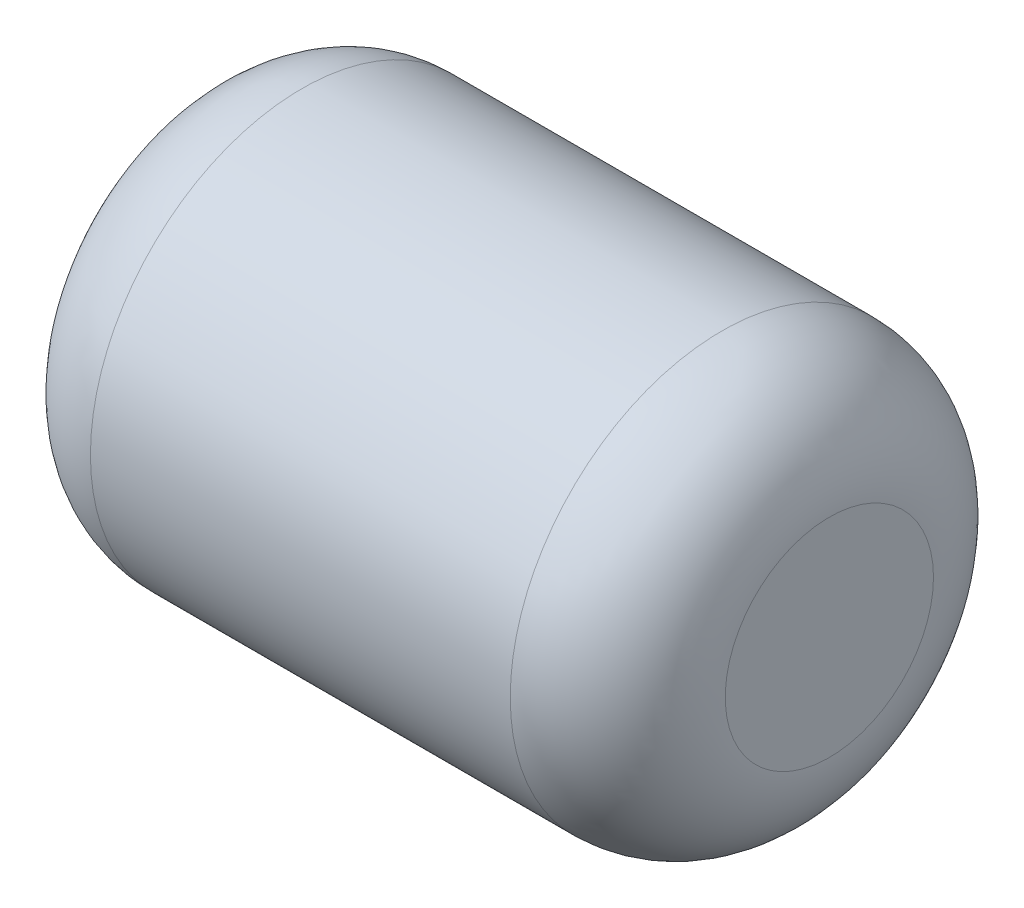
ISO-10303-21;
HEADER;
FILE_DESCRIPTION(('STEP AP214'),'2;1');
FILE_NAME('part.step','',(''),(''),'','','');
FILE_SCHEMA(('AUTOMOTIVE_DESIGN { 1 0 10303 214 1 1 1 1 }'));
ENDSEC;
DATA;
#1=APPLICATION_CONTEXT('core data for automotive mechanical design processes');
#2=APPLICATION_PROTOCOL_DEFINITION('international standard','automotive_design',2000,#1);
#3=PRODUCT_CONTEXT('',#1,'mechanical');
#4=PRODUCT('Part','Part','',(#3));
#5=PRODUCT_RELATED_PRODUCT_CATEGORY('part','',(#4));
#6=PRODUCT_DEFINITION_FORMATION('','',#4);
#7=PRODUCT_DEFINITION_CONTEXT('part definition',#1,'design');
#8=PRODUCT_DEFINITION('design','',#6,#7);
#9=PRODUCT_DEFINITION_SHAPE('','',#8);
#10=(LENGTH_UNIT() NAMED_UNIT(*) SI_UNIT(.MILLI.,.METRE.));
#11=(NAMED_UNIT(*) PLANE_ANGLE_UNIT() SI_UNIT($,.RADIAN.));
#12=(NAMED_UNIT(*) SI_UNIT($,.STERADIAN.) SOLID_ANGLE_UNIT());
#13=UNCERTAINTY_MEASURE_WITH_UNIT(LENGTH_MEASURE(1.E-05),#10,'distance_accuracy_value','');
#14=(GEOMETRIC_REPRESENTATION_CONTEXT(3) GLOBAL_UNCERTAINTY_ASSIGNED_CONTEXT((#13)) GLOBAL_UNIT_ASSIGNED_CONTEXT((#10,
#11,#12)) REPRESENTATION_CONTEXT('',''));
#15=CARTESIAN_POINT('',(0.,0.,0.));
#16=DIRECTION('',(0.,0.,1.));
#17=DIRECTION('',(1.,0.,0.));
#18=AXIS2_PLACEMENT_3D('',#15,#16,#17);
#19=CARTESIAN_POINT('',(3.,0.,0.));
#20=DIRECTION('',(-1.,0.,0.));
#21=DIRECTION('',(0.,0.,1.));
#22=AXIS2_PLACEMENT_3D('',#19,#20,#21);
#23=CYLINDRICAL_SURFACE('',#22,1.);
#24=CARTESIAN_POINT('',(0.508,0.,0.));
#25=DIRECTION('',(1.,0.,0.));
#26=DIRECTION('',(0.,0.,-1.));
#27=AXIS2_PLACEMENT_3D('',#24,#25,#26);
#28=CIRCLE('',#27,1.);
#29=CARTESIAN_POINT('',(0.508,0.,-1.));
#30=VERTEX_POINT('',#29);
#31=EDGE_CURVE('E41',#30,#30,#28,.T.);
#32=ORIENTED_EDGE('',*,*,#31,.T.);
#33=EDGE_LOOP('',(#32));
#34=FACE_BOUND('',#33,.T.);
#35=CARTESIAN_POINT('',(2.492,0.,0.));
#36=DIRECTION('',(1.,0.,0.));
#37=DIRECTION('',(0.,0.,-1.));
#38=AXIS2_PLACEMENT_3D('',#35,#36,#37);
#39=CIRCLE('',#38,1.);
#40=CARTESIAN_POINT('',(2.492,0.,-1.));
#41=VERTEX_POINT('',#40);
#42=EDGE_CURVE('E45',#41,#41,#39,.F.);
#43=ORIENTED_EDGE('',*,*,#42,.T.);
#44=EDGE_LOOP('',(#43));
#45=FACE_BOUND('',#44,.T.);
#46=ADVANCED_FACE('F30',(#34,#45),#23,.T.);
#47=CARTESIAN_POINT('',(3.,0.,0.));
#48=DIRECTION('',(1.,0.,0.));
#49=DIRECTION('',(0.,0.,-1.));
#50=AXIS2_PLACEMENT_3D('',#47,#48,#49);
#51=PLANE('',#50);
#52=CARTESIAN_POINT('',(3.,0.,0.));
#53=DIRECTION('',(1.,0.,0.));
#54=DIRECTION('',(0.,0.,-1.));
#55=AXIS2_PLACEMENT_3D('',#52,#53,#54);
#56=CIRCLE('',#55,0.492);
#57=CARTESIAN_POINT('',(3.,0.,-0.492));
#58=VERTEX_POINT('',#57);
#59=EDGE_CURVE('E10',#58,#58,#56,.T.);
#60=ORIENTED_EDGE('',*,*,#59,.T.);
#61=EDGE_LOOP('',(#60));
#62=FACE_BOUND('',#61,.T.);
#63=ADVANCED_FACE('F61',(#62),#51,.T.);
#64=CARTESIAN_POINT('',(0.,0.,0.));
#65=DIRECTION('',(1.,0.,0.));
#66=DIRECTION('',(0.,0.,-1.));
#67=AXIS2_PLACEMENT_3D('',#64,#65,#66);
#68=PLANE('',#67);
#69=CARTESIAN_POINT('',(0.,0.,0.));
#70=DIRECTION('',(1.,0.,0.));
#71=DIRECTION('',(0.,0.,-1.));
#72=AXIS2_PLACEMENT_3D('',#69,#70,#71);
#73=CIRCLE('',#72,0.492);
#74=CARTESIAN_POINT('',(0.,0.,-0.492));
#75=VERTEX_POINT('',#74);
#76=EDGE_CURVE('E37',#75,#75,#73,.F.);
#77=ORIENTED_EDGE('',*,*,#76,.T.);
#78=EDGE_LOOP('',(#77));
#79=FACE_BOUND('',#78,.T.);
#80=ADVANCED_FACE('F58',(#79),#68,.F.);
#81=CARTESIAN_POINT('',(0.508,0.,0.));
#82=DIRECTION('',(1.,0.,0.));
#83=DIRECTION('',(0.,0.,-1.));
#84=AXIS2_PLACEMENT_3D('',#81,#82,#83);
#85=DEGENERATE_TOROIDAL_SURFACE('',#84,0.492,0.508,.T.);
#86=ORIENTED_EDGE('',*,*,#76,.F.);
#87=EDGE_LOOP('',(#86));
#88=FACE_BOUND('',#87,.T.);
#89=ORIENTED_EDGE('',*,*,#31,.F.);
#90=EDGE_LOOP('',(#89));
#91=FACE_BOUND('',#90,.T.);
#92=ADVANCED_FACE('F54',(#88,#91),#85,.T.);
#93=CARTESIAN_POINT('',(2.492,0.,0.));
#94=DIRECTION('',(1.,0.,0.));
#95=DIRECTION('',(0.,0.,-1.));
#96=AXIS2_PLACEMENT_3D('',#93,#94,#95);
#97=DEGENERATE_TOROIDAL_SURFACE('',#96,0.492,0.508,.T.);
#98=ORIENTED_EDGE('',*,*,#42,.F.);
#99=EDGE_LOOP('',(#98));
#100=FACE_BOUND('',#99,.T.);
#101=ORIENTED_EDGE('',*,*,#59,.F.);
#102=EDGE_LOOP('',(#101));
#103=FACE_BOUND('',#102,.T.);
#104=ADVANCED_FACE('F32',(#100,#103),#97,.T.);
#105=CLOSED_SHELL('',(#46,#63,#80,#92,#104));
#106=MANIFOLD_SOLID_BREP('B2',#105);
#107=ADVANCED_BREP_SHAPE_REPRESENTATION('',(#18,#106),#14);
#108=SHAPE_DEFINITION_REPRESENTATION(#9,#107);
ENDSEC;
END-ISO-10303-21;
